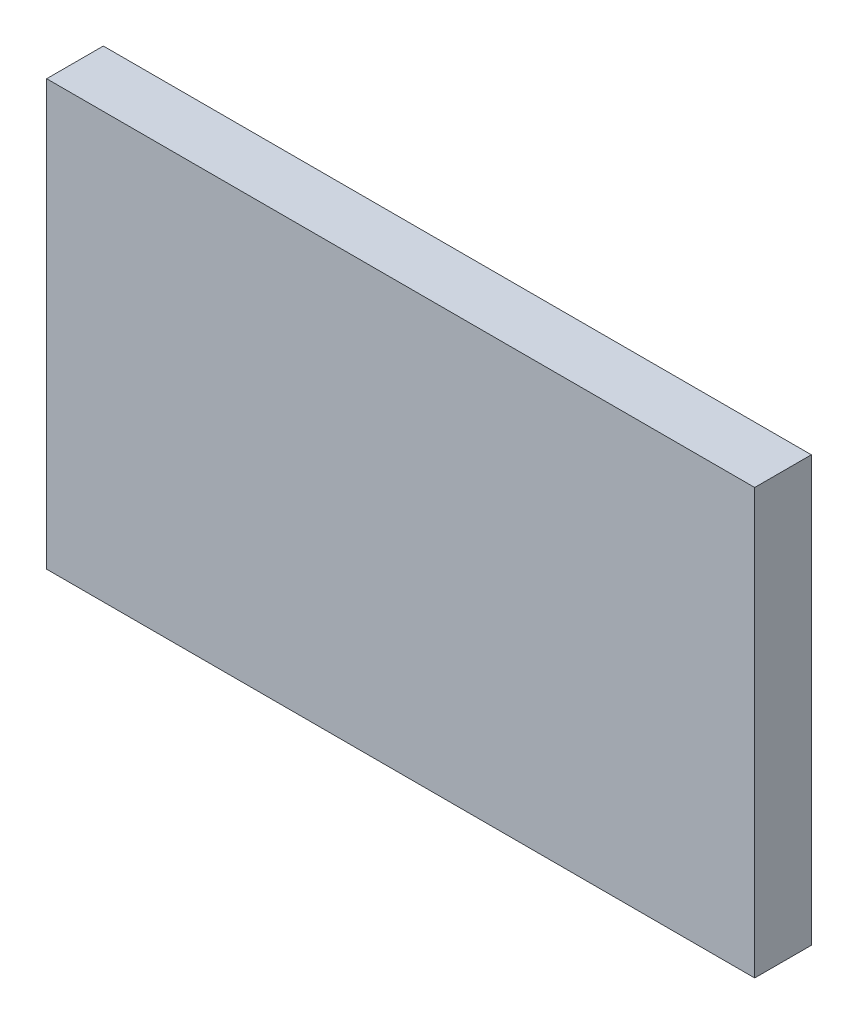
ISO-10303-21;
HEADER;
FILE_DESCRIPTION(('STEP AP214'),'2;1');
FILE_NAME('part.step','',(''),(''),'','','');
FILE_SCHEMA(('AUTOMOTIVE_DESIGN { 1 0 10303 214 1 1 1 1 }'));
ENDSEC;
DATA;
#1=APPLICATION_CONTEXT('core data for automotive mechanical design processes');
#2=APPLICATION_PROTOCOL_DEFINITION('international standard','automotive_design',2000,#1);
#3=PRODUCT_CONTEXT('',#1,'mechanical');
#4=PRODUCT('Part','Part','',(#3));
#5=PRODUCT_RELATED_PRODUCT_CATEGORY('part','',(#4));
#6=PRODUCT_DEFINITION_FORMATION('','',#4);
#7=PRODUCT_DEFINITION_CONTEXT('part definition',#1,'design');
#8=PRODUCT_DEFINITION('design','',#6,#7);
#9=PRODUCT_DEFINITION_SHAPE('','',#8);
#10=(LENGTH_UNIT() NAMED_UNIT(*) SI_UNIT(.MILLI.,.METRE.));
#11=(NAMED_UNIT(*) PLANE_ANGLE_UNIT() SI_UNIT($,.RADIAN.));
#12=(NAMED_UNIT(*) SI_UNIT($,.STERADIAN.) SOLID_ANGLE_UNIT());
#13=UNCERTAINTY_MEASURE_WITH_UNIT(LENGTH_MEASURE(1.E-05),#10,'distance_accuracy_value','');
#14=(GEOMETRIC_REPRESENTATION_CONTEXT(3) GLOBAL_UNCERTAINTY_ASSIGNED_CONTEXT((#13)) GLOBAL_UNIT_ASSIGNED_CONTEXT((#10,
#11,#12)) REPRESENTATION_CONTEXT('',''));
#15=CARTESIAN_POINT('',(0.,0.,0.));
#16=DIRECTION('',(0.,0.,1.));
#17=DIRECTION('',(1.,0.,0.));
#18=AXIS2_PLACEMENT_3D('',#15,#16,#17);
#19=CARTESIAN_POINT('',(0.,0.,16.));
#20=DIRECTION('',(1.,0.,0.));
#21=DIRECTION('',(0.,1.,0.));
#22=AXIS2_PLACEMENT_3D('',#19,#20,#21);
#23=PLANE('',#22);
#24=DIRECTION('',(0.,-1.,0.));
#25=VECTOR('',#24,1.);
#26=CARTESIAN_POINT('',(0.,0.,0.));
#27=LINE('',#26,#25);
#28=CARTESIAN_POINT('',(0.,120.,0.));
#29=VERTEX_POINT('',#28);
#30=CARTESIAN_POINT('',(0.,0.,0.));
#31=VERTEX_POINT('',#30);
#32=EDGE_CURVE('E96',#29,#31,#27,.T.);
#33=ORIENTED_EDGE('',*,*,#32,.T.);
#34=DIRECTION('',(0.,0.,-1.));
#35=VECTOR('',#34,1.);
#36=CARTESIAN_POINT('',(0.,0.,16.));
#37=LINE('',#36,#35);
#38=CARTESIAN_POINT('',(0.,0.,16.));
#39=VERTEX_POINT('',#38);
#40=EDGE_CURVE('E11',#39,#31,#37,.T.);
#41=ORIENTED_EDGE('',*,*,#40,.F.);
#42=DIRECTION('',(0.,-1.,0.));
#43=VECTOR('',#42,1.);
#44=CARTESIAN_POINT('',(0.,0.,16.));
#45=LINE('',#44,#43);
#46=CARTESIAN_POINT('',(0.,120.,16.));
#47=VERTEX_POINT('',#46);
#48=EDGE_CURVE('E84',#47,#39,#45,.T.);
#49=ORIENTED_EDGE('',*,*,#48,.F.);
#50=DIRECTION('',(0.,0.,-1.));
#51=VECTOR('',#50,1.);
#52=CARTESIAN_POINT('',(0.,120.,16.));
#53=LINE('',#52,#51);
#54=EDGE_CURVE('E92',#47,#29,#53,.T.);
#55=ORIENTED_EDGE('',*,*,#54,.T.);
#56=EDGE_LOOP('',(#33,#41,#49,#55));
#57=FACE_BOUND('',#56,.T.);
#58=ADVANCED_FACE('F33',(#57),#23,.F.);
#59=CARTESIAN_POINT('',(0.,0.,16.));
#60=DIRECTION('',(0.,1.,0.));
#61=DIRECTION('',(0.,0.,1.));
#62=AXIS2_PLACEMENT_3D('',#59,#60,#61);
#63=PLANE('',#62);
#64=DIRECTION('',(1.,0.,0.));
#65=VECTOR('',#64,1.);
#66=CARTESIAN_POINT('',(0.,0.,0.));
#67=LINE('',#66,#65);
#68=CARTESIAN_POINT('',(200.,0.,0.));
#69=VERTEX_POINT('',#68);
#70=EDGE_CURVE('E88',#31,#69,#67,.T.);
#71=ORIENTED_EDGE('',*,*,#70,.T.);
#72=DIRECTION('',(0.,0.,-1.));
#73=VECTOR('',#72,1.);
#74=CARTESIAN_POINT('',(200.,0.,16.));
#75=LINE('',#74,#73);
#76=CARTESIAN_POINT('',(200.,0.,16.));
#77=VERTEX_POINT('',#76);
#78=EDGE_CURVE('E41',#77,#69,#75,.T.);
#79=ORIENTED_EDGE('',*,*,#78,.F.);
#80=DIRECTION('',(1.,0.,0.));
#81=VECTOR('',#80,1.);
#82=CARTESIAN_POINT('',(0.,0.,16.));
#83=LINE('',#82,#81);
#84=EDGE_CURVE('E79',#39,#77,#83,.T.);
#85=ORIENTED_EDGE('',*,*,#84,.F.);
#86=ORIENTED_EDGE('',*,*,#40,.T.);
#87=EDGE_LOOP('',(#71,#79,#85,#86));
#88=FACE_BOUND('',#87,.T.);
#89=ADVANCED_FACE('F87',(#88),#63,.F.);
#90=CARTESIAN_POINT('',(200.,0.,16.));
#91=DIRECTION('',(-1.,0.,0.));
#92=DIRECTION('',(0.,-1.,0.));
#93=AXIS2_PLACEMENT_3D('',#90,#91,#92);
#94=PLANE('',#93);
#95=DIRECTION('',(0.,1.,0.));
#96=VECTOR('',#95,1.);
#97=CARTESIAN_POINT('',(200.,0.,0.));
#98=LINE('',#97,#96);
#99=CARTESIAN_POINT('',(200.,120.,0.));
#100=VERTEX_POINT('',#99);
#101=EDGE_CURVE('E66',#69,#100,#98,.T.);
#102=ORIENTED_EDGE('',*,*,#101,.T.);
#103=DIRECTION('',(0.,0.,-1.));
#104=VECTOR('',#103,1.);
#105=CARTESIAN_POINT('',(200.,120.,16.));
#106=LINE('',#105,#104);
#107=CARTESIAN_POINT('',(200.,120.,16.));
#108=VERTEX_POINT('',#107);
#109=EDGE_CURVE('E89',#108,#100,#106,.T.);
#110=ORIENTED_EDGE('',*,*,#109,.F.);
#111=DIRECTION('',(0.,1.,0.));
#112=VECTOR('',#111,1.);
#113=CARTESIAN_POINT('',(200.,0.,16.));
#114=LINE('',#113,#112);
#115=EDGE_CURVE('E82',#77,#108,#114,.T.);
#116=ORIENTED_EDGE('',*,*,#115,.F.);
#117=ORIENTED_EDGE('',*,*,#78,.T.);
#118=EDGE_LOOP('',(#102,#110,#116,#117));
#119=FACE_BOUND('',#118,.T.);
#120=ADVANCED_FACE('F90',(#119),#94,.F.);
#121=CARTESIAN_POINT('',(0.,120.,16.));
#122=DIRECTION('',(0.,-1.,0.));
#123=DIRECTION('',(0.,0.,-1.));
#124=AXIS2_PLACEMENT_3D('',#121,#122,#123);
#125=PLANE('',#124);
#126=DIRECTION('',(-1.,0.,0.));
#127=VECTOR('',#126,1.);
#128=CARTESIAN_POINT('',(0.,120.,0.));
#129=LINE('',#128,#127);
#130=EDGE_CURVE('E72',#100,#29,#129,.T.);
#131=ORIENTED_EDGE('',*,*,#130,.T.);
#132=ORIENTED_EDGE('',*,*,#54,.F.);
#133=DIRECTION('',(-1.,0.,0.));
#134=VECTOR('',#133,1.);
#135=CARTESIAN_POINT('',(0.,120.,16.));
#136=LINE('',#135,#134);
#137=EDGE_CURVE('E49',#108,#47,#136,.T.);
#138=ORIENTED_EDGE('',*,*,#137,.F.);
#139=ORIENTED_EDGE('',*,*,#109,.T.);
#140=EDGE_LOOP('',(#131,#132,#138,#139));
#141=FACE_BOUND('',#140,.T.);
#142=ADVANCED_FACE('F103',(#141),#125,.F.);
#143=CARTESIAN_POINT('',(0.,0.,16.));
#144=DIRECTION('',(0.,0.,-1.));
#145=DIRECTION('',(-1.,0.,0.));
#146=AXIS2_PLACEMENT_3D('',#143,#144,#145);
#147=PLANE('',#146);
#148=ORIENTED_EDGE('',*,*,#48,.T.);
#149=ORIENTED_EDGE('',*,*,#84,.T.);
#150=ORIENTED_EDGE('',*,*,#115,.T.);
#151=ORIENTED_EDGE('',*,*,#137,.T.);
#152=EDGE_LOOP('',(#148,#149,#150,#151));
#153=FACE_BOUND('',#152,.T.);
#154=ADVANCED_FACE('F80',(#153),#147,.F.);
#155=CARTESIAN_POINT('',(0.,0.,0.));
#156=DIRECTION('',(0.,0.,-1.));
#157=DIRECTION('',(-1.,0.,0.));
#158=AXIS2_PLACEMENT_3D('',#155,#156,#157);
#159=PLANE('',#158);
#160=ORIENTED_EDGE('',*,*,#32,.F.);
#161=ORIENTED_EDGE('',*,*,#130,.F.);
#162=ORIENTED_EDGE('',*,*,#101,.F.);
#163=ORIENTED_EDGE('',*,*,#70,.F.);
#164=EDGE_LOOP('',(#160,#161,#162,#163));
#165=FACE_BOUND('',#164,.T.);
#166=ADVANCED_FACE('F106',(#165),#159,.T.);
#167=CLOSED_SHELL('',(#58,#89,#120,#142,#154,#166));
#168=MANIFOLD_SOLID_BREP('B2',#167);
#169=ADVANCED_BREP_SHAPE_REPRESENTATION('',(#18,#168),#14);
#170=SHAPE_DEFINITION_REPRESENTATION(#9,#169);
ENDSEC;
END-ISO-10303-21;
